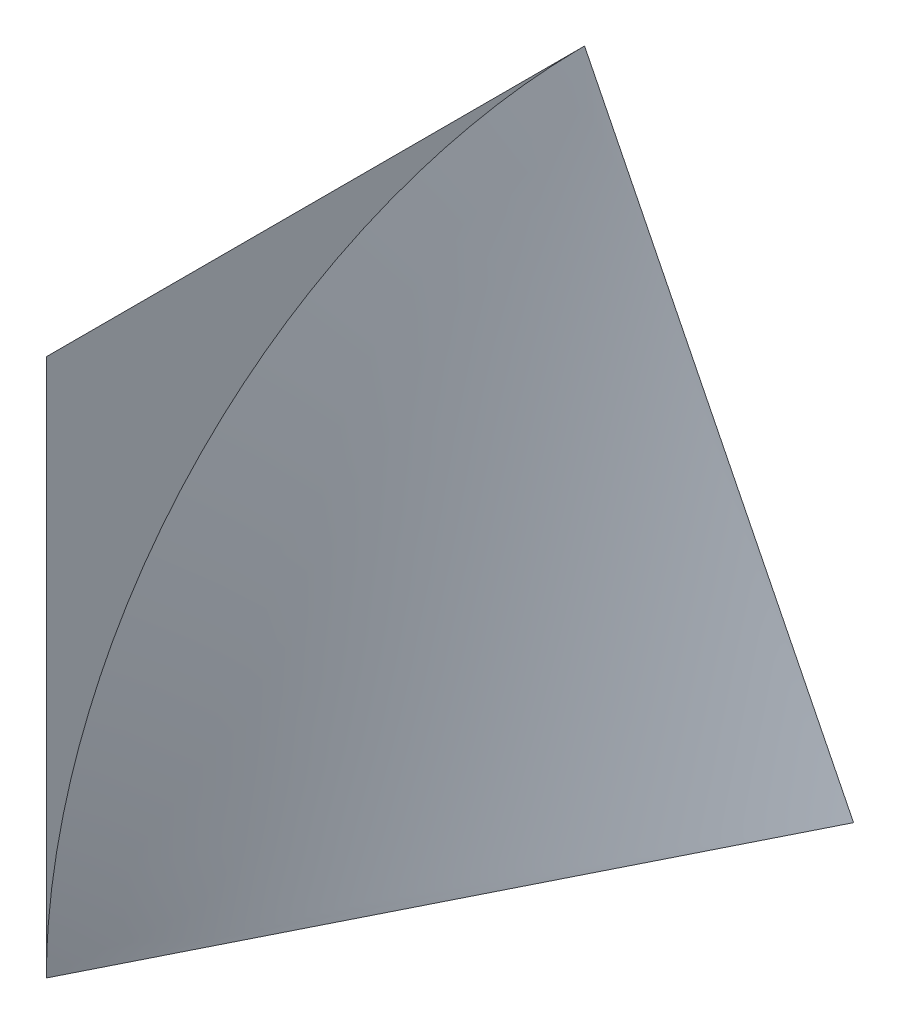
ISO-10303-21;
HEADER;
FILE_DESCRIPTION(('STEP AP214'),'2;1');
FILE_NAME('part.step','',(''),(''),'','','');
FILE_SCHEMA(('AUTOMOTIVE_DESIGN { 1 0 10303 214 1 1 1 1 }'));
ENDSEC;
DATA;
#1=APPLICATION_CONTEXT('core data for automotive mechanical design processes');
#2=APPLICATION_PROTOCOL_DEFINITION('international standard','automotive_design',2000,#1);
#3=PRODUCT_CONTEXT('',#1,'mechanical');
#4=PRODUCT('Part','Part','',(#3));
#5=PRODUCT_RELATED_PRODUCT_CATEGORY('part','',(#4));
#6=PRODUCT_DEFINITION_FORMATION('','',#4);
#7=PRODUCT_DEFINITION_CONTEXT('part definition',#1,'design');
#8=PRODUCT_DEFINITION('design','',#6,#7);
#9=PRODUCT_DEFINITION_SHAPE('','',#8);
#10=(LENGTH_UNIT() NAMED_UNIT(*) SI_UNIT(.MILLI.,.METRE.));
#11=(NAMED_UNIT(*) PLANE_ANGLE_UNIT() SI_UNIT($,.RADIAN.));
#12=(NAMED_UNIT(*) SI_UNIT($,.STERADIAN.) SOLID_ANGLE_UNIT());
#13=UNCERTAINTY_MEASURE_WITH_UNIT(LENGTH_MEASURE(1.E-05),#10,'distance_accuracy_value','');
#14=(GEOMETRIC_REPRESENTATION_CONTEXT(3) GLOBAL_UNCERTAINTY_ASSIGNED_CONTEXT((#13)) GLOBAL_UNIT_ASSIGNED_CONTEXT((#10,
#11,#12)) REPRESENTATION_CONTEXT('',''));
#15=CARTESIAN_POINT('',(0.,0.,0.));
#16=DIRECTION('',(0.,0.,1.));
#17=DIRECTION('',(1.,0.,0.));
#18=AXIS2_PLACEMENT_3D('',#15,#16,#17);
#19=CARTESIAN_POINT('',(0.,0.,0.));
#20=DIRECTION('',(0.,-1.,0.));
#21=DIRECTION('',(0.,0.,-1.));
#22=AXIS2_PLACEMENT_3D('',#19,#20,#21);
#23=PLANE('',#22);
#24=DIRECTION('',(0.447188418671129,0.,0.894439778971405));
#25=VECTOR('',#24,1.);
#26=CARTESIAN_POINT('',(-1.99987335916185,0.,-2.00000031664622));
#27=LINE('',#26,#25);
#28=CARTESIAN_POINT('',(-1.99987335916185,1.37456985586429E-05,-2.00000031664622));
#29=VERTEX_POINT('',#28);
#30=CARTESIAN_POINT('',(-3.56157288495491E-05,6.97657941034187E-05,2.00006976573752));
#31=VERTEX_POINT('',#30);
#32=EDGE_CURVE('E89',#29,#31,#27,.T.);
#33=ORIENTED_EDGE('',*,*,#32,.F.);
#34=DIRECTION('',(-1.,0.,0.));
#35=VECTOR('',#34,1.);
#36=CARTESIAN_POINT('',(-2.,0.,-2.));
#37=LINE('',#36,#35);
#38=CARTESIAN_POINT('',(1.99989168434998,-8.3713605003607E-06,-2.0000083713605));
#39=VERTEX_POINT('',#38);
#40=EDGE_CURVE('E57',#39,#29,#37,.T.);
#41=ORIENTED_EDGE('',*,*,#40,.F.);
#42=CARTESIAN_POINT('',(0.000875798366615509,0.000279063176195504,2.00027906272354));
#43=CARTESIAN_POINT('',(0.0837069902664033,0.000114321391326568,1.83341790211676));
#44=CARTESIAN_POINT('',(0.166760266654798,2.5824815957855E-05,1.66666738616965));
#45=CARTESIAN_POINT('',(0.333150650163644,-6.07299361798723E-05,1.33325678604981));
#46=CARTESIAN_POINT('',(0.416487821975475,-5.87658988175555E-05,1.16659673413993));
#47=CARTESIAN_POINT('',(0.5832516993621,-2.6430144579629E-05,0.833304277000826));
#48=CARTESIAN_POINT('',(0.66667841177579,3.94392325566219E-06,0.666671875201032));
#49=CARTESIAN_POINT('',(0.833462796655206,4.21516981306896E-05,0.333381132018225));
#50=CARTESIAN_POINT('',(0.91682047184071,4.99863399270686E-05,0.166722791997599));
#51=CARTESIAN_POINT('',(1.08344561174981,3.64771559339593E-05,-0.166625790121181));
#52=CARTESIAN_POINT('',(1.16671308184419,1.51351750872063E-05,-0.333316029535826));
#53=CARTESIAN_POINT('',(1.33324950456927,-2.7255169058637E-05,-0.666697336870446));
#54=CARTESIAN_POINT('',(1.41651845720639,-4.83035301613499E-05,-0.833388404787299));
#55=CARTESIAN_POINT('',(1.58319168850622,-4.59503601463192E-05,-1.16671774407098));
#56=CARTESIAN_POINT('',(1.66659597640317,-2.25456564726301E-05,-1.33335601082054));
#57=CARTESIAN_POINT('',(1.8333375242331,2.90581819594307E-06,-1.66665390369432));
#58=CARTESIAN_POINT('',(1.91667478779334,4.95383540343697E-06,-1.83331352800475));
#59=CARTESIAN_POINT('',(1.99988521040192,-3.65764076934509E-05,-2.00003657640769));
#60=B_SPLINE_CURVE_WITH_KNOTS('',3,(#42,#43,#44,#45,#46,#47,#48,#49,#50,#51,#52,#53,#54,#55,#56,
#57,#58,#59),.UNSPECIFIED.,.F.,.F.,(4,2,2,2,2,2,2,2,4),(0.,0.558866956671007,1.117871153294,
1.67692161219078,2.23594888577383,2.79494081168776,3.35393691681514,3.91297291824808,
4.47197629844018),.UNSPECIFIED.);
#61=EDGE_CURVE('E73',#39,#31,#60,.F.);
#62=ORIENTED_EDGE('',*,*,#61,.T.);
#63=EDGE_LOOP('',(#33,#41,#62));
#64=FACE_BOUND('',#63,.T.);
#65=ADVANCED_FACE('F45',(#64),#23,.T.);
#66=CARTESIAN_POINT('',(-2.,4.,-2.));
#67=DIRECTION('',(0.,0.,1.));
#68=DIRECTION('',(1.,0.,0.));
#69=AXIS2_PLACEMENT_3D('',#66,#67,#68);
#70=PLANE('',#69);
#71=ORIENTED_EDGE('',*,*,#40,.T.);
#72=DIRECTION('',(0.447189270772676,0.894439352950105,0.));
#73=VECTOR('',#72,1.);
#74=CARTESIAN_POINT('',(-1.99989639075497,-9.28745872898386E-06,-2.));
#75=LINE('',#74,#73);
#76=CARTESIAN_POINT('',(-1.39406305274967E-05,4.00002756846773,-1.99997243153227));
#77=VERTEX_POINT('',#76);
#78=EDGE_CURVE('E227',#29,#77,#75,.T.);
#79=ORIENTED_EDGE('',*,*,#78,.T.);
#80=CARTESIAN_POINT('',(1.99988521040192,-3.65764076902739E-05,-2.00003657640769));
#81=CARTESIAN_POINT('',(1.91654485122619,0.166627903865693,-2.00003880792397));
#82=CARTESIAN_POINT('',(1.83320103399918,0.333290657306252,-2.0000422271948));
#83=CARTESIAN_POINT('',(1.66652639514234,0.666620305131661,-2.00004492483027));
#84=CARTESIAN_POINT('',(1.58319557337616,0.833287199448332,-2.00004420324175));
#85=CARTESIAN_POINT('',(1.41656681786021,1.16663275869716,-2.0000321032242));
#86=CARTESIAN_POINT('',(1.33326888341521,1.33331142328179,-2.000020725034));
#87=CARTESIAN_POINT('',(1.16668077614414,1.66667133956219,-1.99999547984068));
#88=CARTESIAN_POINT('',(1.0833906032732,1.83335259123553,-1.99998161285297));
#89=CARTESIAN_POINT('',(0.916788519100106,2.16670770044612,-1.99996086981952));
#90=CARTESIAN_POINT('',(0.833476607459166,2.3333815578141,-1.99995399389016));
#91=CARTESIAN_POINT('',(0.666818288562755,2.66671732680947,-1.99995136478653));
#92=CARTESIAN_POINT('',(0.583471880483026,2.83337923802468,-1.99995561189546));
#93=CARTESIAN_POINT('',(0.416766179249375,3.16669651780215,-1.99996854669685));
#94=CARTESIAN_POINT('',(0.333406886102092,3.33335188636771,-1.99997723438705));
#95=CARTESIAN_POINT('',(0.166782488533559,3.66669263770975,-1.99996459731462));
#96=CARTESIAN_POINT('',(0.0835173769603532,3.83337801691231,-1.99994327500886));
#97=CARTESIAN_POINT('',(0.000346078090228706,4.00011027387091,-1.99988972612908));
#98=B_SPLINE_CURVE_WITH_KNOTS('',3,(#80,#81,#82,#83,#84,#85,#86,#87,#88,#89,#90,#91,#92,#93,#94,
#95,#96,#97),.UNSPECIFIED.,.F.,.F.,(4,2,2,2,2,2,2,2,4),(0.,0.559020558287219,1.11803479226773,
1.67703649758111,2.23603474063693,2.79504228889593,3.35406406956563,3.91308556318331,
4.47206129348129),.UNSPECIFIED.);
#99=EDGE_CURVE('E107',#77,#39,#98,.F.);
#100=ORIENTED_EDGE('',*,*,#99,.T.);
#101=EDGE_LOOP('',(#71,#79,#100));
#102=FACE_BOUND('',#101,.T.);
#103=ADVANCED_FACE('F47',(#102),#70,.F.);
#104=CARTESIAN_POINT('',(-0.0223445822368762,4.04551000308371,-2.05013568896862));
#105=CARTESIAN_POINT('',(0.389245917586985,3.22979955401737,-2.04815105747686));
#106=CARTESIAN_POINT('',(0.80376631841207,2.41502268478151,-2.04523284615462));
#107=CARTESIAN_POINT('',(1.2138327944319,1.59882662275964,-2.0437338276184));
#108=CARTESIAN_POINT('',(1.62547477029438,0.783132575951057,-2.04173279386888));
#109=CARTESIAN_POINT('',(2.0363210381082,-0.0328150142314784,-2.03998530349331));
#110=CARTESIAN_POINT('',(-0.00157645550172039,4.01078979222863,-1.12088691832415));
#111=CARTESIAN_POINT('',(0.330782508042385,3.1698331098672,-1.14414852012748));
#112=CARTESIAN_POINT('',(0.661463515093786,2.32834176563927,-1.16794478379732));
#113=CARTESIAN_POINT('',(0.998024508618965,1.48872401262588,-1.1898674562526));
#114=CARTESIAN_POINT('',(1.3496576785027,0.65390883821288,-1.20698755010751));
#115=CARTESIAN_POINT('',(1.70166608078987,-0.180786772636899,-1.22398808039919));
#116=CARTESIAN_POINT('',(-0.0801410042412669,3.94441834732446,-0.223289381728774));
#117=CARTESIAN_POINT('',(0.212645880851122,3.09085246954069,-0.259160178954445));
#118=CARTESIAN_POINT('',(0.487497486294741,2.23157171766153,-0.3007458502755));
#119=CARTESIAN_POINT('',(0.76296722670346,1.37248792750071,-0.342134559878237));
#120=CARTESIAN_POINT('',(1.0370474490773,0.512961383127122,-0.383966023693716));
#121=CARTESIAN_POINT('',(1.33318970498991,-0.339535343678444,-0.418767669941185));
#122=CARTESIAN_POINT('',(-0.225399102421753,3.85679575688504,0.653057009331347));
#123=CARTESIAN_POINT('',(0.0687644817012423,3.00366854868332,0.617624881687722));
#124=CARTESIAN_POINT('',(0.316590909279943,2.13577652940659,0.567427942969095));
#125=CARTESIAN_POINT('',(0.464826169582532,1.23615091059074,0.485497404711355));
#126=CARTESIAN_POINT('',(0.713655116844502,0.368578332877242,0.435619907555955));
#127=CARTESIAN_POINT('',(0.961196515742705,-0.499404507566119,0.385332147670681));
#128=CARTESIAN_POINT('',(-0.42444655194897,3.75203379774657,1.51226403169242));
#129=CARTESIAN_POINT('',(-0.154207559267555,2.8912832889579,1.46920860346185));
#130=CARTESIAN_POINT('',(0.0680055397752079,2.01522987211099,1.41085026717304));
#131=CARTESIAN_POINT('',(0.208824710855955,1.11324120030595,1.32655667592612));
#132=CARTESIAN_POINT('',(0.366742160711515,0.216700701730546,1.2477112579088));
#133=CARTESIAN_POINT('',(0.522343418228537,-0.680577825348242,1.1681278113881));
#134=CARTESIAN_POINT('',(-0.662558095217739,3.6348245067707,2.35902372221611));
#135=CARTESIAN_POINT('',(-0.408614144013187,2.76888176723662,2.31077606324013));
#136=CARTESIAN_POINT('',(-0.203038330924701,1.88752706731073,2.24711644387233));
#137=CARTESIAN_POINT('',(-0.0425084820645144,0.991818980144022,2.16910343726371));
#138=CARTESIAN_POINT('',(-0.0322366133536195,0.048232886322163,2.04321242399998));
#139=CARTESIAN_POINT('',(0.0386648782400475,-0.876034263607353,1.93664035462853));
#140=B_SPLINE_SURFACE_WITH_KNOTS('',5,5,((#104,#105,#106,#107,#108,#109),(#110,#111,#112,#113,
#114,#115),(#116,#117,#118,#119,#120,#121),(#122,#123,#124,#125,#126,#127),(#128,#129,#130,#131,
#132,#133),(#134,#135,#136,#137,#138,#139)),.UNSPECIFIED.,.F.,.F.,.F.,(6,6),(6,6),
(-1.64494672878529,2.79186118228678),(-2.54970046226169,1.96558601863418),.UNSPECIFIED.);
#141=CARTESIAN_POINT('',(0.000346078090228502,4.00011027387092,-1.99988972612909));
#142=CARTESIAN_POINT('',(0.000340741411696202,4.00010857405014,-1.99897851564378));
#143=CARTESIAN_POINT('',(0.000335437691624804,4.00010657119289,-1.99806730553074));
#144=CARTESIAN_POINT('',(0.000324895936222993,4.00010195943391,-1.99624492105267));
#145=CARTESIAN_POINT('',(0.000319657898406586,4.0000993505552,-1.99533374668759));
#146=CARTESIAN_POINT('',(0.000309247068695348,4.00009352676374,-1.99351143426773));
#147=CARTESIAN_POINT('',(0.000304074274320183,4.00009031187411,-1.99260029621289));
#148=CARTESIAN_POINT('',(0.00029379349458493,4.00008327607177,-1.99077805697498));
#149=CARTESIAN_POINT('',(0.000288685506750293,4.00007945518227,-1.98986695579183));
#150=CARTESIAN_POINT('',(0.000278533904599104,4.00007120739162,-1.98804479085794));
#151=CARTESIAN_POINT('',(0.00027349028781393,4.00006678051379,-1.98713372710711));
#152=CARTESIAN_POINT('',(0.000263466993815141,4.00005732075837,-1.98531163759767));
#153=CARTESIAN_POINT('',(0.000258487314138966,4.00005228790421,-1.98440061183894));
#154=CARTESIAN_POINT('',(0.000248591461917345,4.00004161620854,-1.9825785988727));
#155=CARTESIAN_POINT('',(0.000243675286915538,4.00003597739054,-1.98166761166505));
#156=CARTESIAN_POINT('',(0.000233906013124367,4.00002409378007,-1.97984567635912));
#157=CARTESIAN_POINT('',(0.000229052911884976,4.00001784901121,-1.97893472826069));
#158=CARTESIAN_POINT('',(0.000219409356213384,4.00000475351239,-1.97711287173051));
#159=CARTESIAN_POINT('',(0.00021461889933762,3.99999790280614,-1.97620196329861));
#160=CARTESIAN_POINT('',(0.000205100204507336,3.99998359544635,-1.97438018665798));
#161=CARTESIAN_POINT('',(0.000200371964115848,3.99997613881663,-1.97346931844909));
#162=CARTESIAN_POINT('',(0.000190977275881993,3.99996061962424,-1.97164762281017));
#163=CARTESIAN_POINT('',(0.000186310825609382,3.99995255708549,-1.97073679537994));
#164=CARTESIAN_POINT('',(0.000177039292757789,3.99993582608984,-1.96891518185321));
#165=CARTESIAN_POINT('',(0.000172434207755413,3.99992715765696,-1.96800439575649));
#166=CARTESIAN_POINT('',(0.000163284982099039,3.99990921488834,-1.96618286545078));
#167=CARTESIAN_POINT('',(0.000158740839028621,3.99989994057671,-1.96527212124157));
#168=CARTESIAN_POINT('',(0.000149713075430851,3.99988078606639,-1.96345067526409));
#169=CARTESIAN_POINT('',(0.000145229452494175,3.99987090589189,-1.96253997349557));
#170=CARTESIAN_POINT('',(0.000136322308768512,3.99985053967208,-1.96071861295185));
#171=CARTESIAN_POINT('',(0.000131898785577424,3.99984005365108,-1.95980795417639));
#172=CARTESIAN_POINT('',(0.000123111422852146,3.99981847575501,-1.95798668017033));
#173=CARTESIAN_POINT('',(0.000118747580923181,3.99980738390434,-1.95707606493946));
#174=CARTESIAN_POINT('',(0.000114413284051044,3.99979598890504,-1.95616545336141));
#175=B_SPLINE_CURVE_WITH_KNOTS('',3,(#141,#142,#143,#144,#145,#146,#147,#148,#149,#150,#151,
#152,#153,#154,#155,#156,#157,#158,#159,#160,#161,#162,#163,#164,#165,#166,#167,#168,#169,#170,
#171,#172,#173,#174),.UNSPECIFIED.,.F.,.F.,(4,2,2,2,2,2,2,2,2,2,2,2,2,2,2,2,4),(0.,
0.00273368304377199,0.00546726230673018,0.00820073733311294,0.0109341076694122,
0.0136673728643797,0.0164005324690386,0.0191335860366666,0.0218665331228122,0.0245993732852783,
0.0273321060841429,0.0300647310817479,0.0327972478426922,0.0355296559338529,0.0382619549243627,
0.0409941443856234,0.0437262238913072),.UNSPECIFIED.);
#176=CARTESIAN_POINT('',(-1.39406305274967E-05,4.00002756846773,-1.95552467436146));
#177=VERTEX_POINT('',#176);
#178=EDGE_CURVE('E164',#77,#177,#175,.T.);
#179=CARTESIAN_POINT('',(0.000114413284051044,3.99979598890504,-1.95616545336141));
#180=CARTESIAN_POINT('',(-4.20759593877336E-05,3.9993834858731,-1.92319617915899));
#181=CARTESIAN_POINT('',(-0.00016069575108772,3.9985734865051,-1.89023165299681));
#182=CARTESIAN_POINT('',(-0.000338348891529763,3.99615812133914,-1.82438591957091));
#183=CARTESIAN_POINT('',(-0.000397479970665175,3.99455406653796,-1.79150466446389));
#184=CARTESIAN_POINT('',(-0.00047264838987511,3.99055246402583,-1.72584958911145));
#185=CARTESIAN_POINT('',(-0.000488762824590513,3.9881563445337,-1.69307568194793));
#186=CARTESIAN_POINT('',(-0.000491279144068526,3.98257343447877,-1.62765813589121));
#187=CARTESIAN_POINT('',(-0.000477737558997291,3.97938815846872,-1.59501436777681));
#188=CARTESIAN_POINT('',(-0.000432158236712272,3.97223056766827,-1.52987866958958));
#189=CARTESIAN_POINT('',(-0.000400157192578298,3.96825982446136,-1.49738656683266));
#190=CARTESIAN_POINT('',(-0.000326639769874252,3.95953574145084,-1.43257458573135));
#191=CARTESIAN_POINT('',(-0.000285142794070655,3.95478400293546,-1.40025449185787));
#192=CARTESIAN_POINT('',(-0.000199611987180522,3.94450313325472,-1.33580580562727));
#193=CARTESIAN_POINT('',(-0.000155583505984348,3.93897560833752,-1.30367695706604));
#194=CARTESIAN_POINT('',(-7.01437501822807E-05,3.92714908737518,-1.23962901351558));
#195=CARTESIAN_POINT('',(-2.87273423747876E-05,3.9208516807513,-1.20770962507078));
#196=CARTESIAN_POINT('',(4.79462731554424E-05,3.90749198360928,-1.14409791685609));
#197=CARTESIAN_POINT('',(8.32156265839337E-05,3.90043124712203,-1.112405270743));
#198=CARTESIAN_POINT('',(0.000145448681763297,3.88555208890956,-1.04926351706417));
#199=CARTESIAN_POINT('',(0.000172428435948133,3.87773517060815,-1.01781405524871));
#200=CARTESIAN_POINT('',(0.00021710879366951,3.86135140284971,-0.955174388306056));
#201=CARTESIAN_POINT('',(0.000234826787253605,3.85278599433924,-0.923983806308075));
#202=CARTESIAN_POINT('',(0.000260961000445859,3.83491349983367,-0.861876959277292));
#203=CARTESIAN_POINT('',(0.000269393990294053,3.82560778367307,-0.830960300052744));
#204=CARTESIAN_POINT('',(0.000277669008786244,3.80626337297501,-0.769415793699323));
#205=CARTESIAN_POINT('',(0.000277525843411784,3.79622597155813,-0.738787540117821));
#206=CARTESIAN_POINT('',(0.000269884616516547,3.77542728381174,-0.677833865223859));
#207=CARTESIAN_POINT('',(0.000262398611557581,3.76466721104786,-0.647508029805282));
#208=CARTESIAN_POINT('',(0.000241638071543765,3.74243262225625,-0.587172822526307));
#209=CARTESIAN_POINT('',(0.000228372529586612,3.73095923983862,-0.557163032894566));
#210=CARTESIAN_POINT('',(0.000197772490382675,3.70730777992897,-0.497473241024717));
#211=CARTESIAN_POINT('',(0.000180443973433798,3.69513075778755,-0.46779282059722));
#212=CARTESIAN_POINT('',(0.000143432385765898,3.67008204337703,-0.408774856273472));
#213=CARTESIAN_POINT('',(0.000123752593008986,3.65721133163229,-0.379436896200637));
#214=CARTESIAN_POINT('',(8.36209617055915E-05,3.63078549970784,-0.321116780724675));
#215=CARTESIAN_POINT('',(6.31701590100113E-05,3.6172312900797,-0.292134212719157));
#216=CARTESIAN_POINT('',(2.28175640227445E-05,3.58944899691501,-0.234537682042815));
#217=CARTESIAN_POINT('',(2.91512946167464E-06,3.57522175980994,-0.205923311071532));
#218=CARTESIAN_POINT('',(-3.52721635850852E-05,3.54610390153392,-0.149075785088087));
#219=CARTESIAN_POINT('',(-5.35588617476297E-05,3.53121406463265,-0.120842228359506));
#220=CARTESIAN_POINT('',(-8.74495268700017E-05,3.50078054695233,-0.0647688166152793));
#221=CARTESIAN_POINT('',(-0.000103056341629801,3.48523758237037,-0.0369285728885716));
#222=CARTESIAN_POINT('',(-0.000130951998178188,3.45350744037006,0.0183459546846189));
#223=CARTESIAN_POINT('',(-0.000143244087711199,3.4373209114901,0.0457806108223146));
#224=CARTESIAN_POINT('',(-0.000164252885244111,3.40431327053554,0.100231805857513));
#225=CARTESIAN_POINT('',(-0.000172972793489886,3.38749274126972,0.127248698045413));
#226=CARTESIAN_POINT('',(-0.000186944142860821,3.35322676132727,0.180852318629018));
#227=CARTESIAN_POINT('',(-0.000192198396193532,3.33578182947221,0.20743937867893));
#228=CARTESIAN_POINT('',(-0.000199657647522486,3.30027673958617,0.260171398652763));
#229=CARTESIAN_POINT('',(-0.000201864859148048,3.28221703796006,0.286316665878083));
#230=CARTESIAN_POINT('',(-0.00020389612454593,3.24549215472583,0.338153283978272));
#231=CARTESIAN_POINT('',(-0.000203721704478984,3.22682736850907,0.363844914976164));
#232=CARTESIAN_POINT('',(-0.000201822680443406,3.18890213218167,0.414762577473964));
#233=CARTESIAN_POINT('',(-0.000200098935166607,3.16964201773232,0.439988858984699));
#234=CARTESIAN_POINT('',(-0.000196013138072276,3.13053603317664,0.489964288435991));
#235=CARTESIAN_POINT('',(-0.00019365138409801,3.11069044023197,0.514713653255582));
#236=CARTESIAN_POINT('',(-0.000189189501416251,3.0704235219132,0.563723881162146));
#237=CARTESIAN_POINT('',(-0.000187089274390844,3.05000241645829,0.58798492493439));
#238=CARTESIAN_POINT('',(-0.000183950472939124,3.00859463320113,0.636007324457802));
#239=CARTESIAN_POINT('',(-0.000182911593917094,2.98760811944074,0.65976882165516));
#240=CARTESIAN_POINT('',(-0.000182516069881732,2.94507983555249,0.706781136890769));
#241=CARTESIAN_POINT('',(-0.000183159094970287,2.92353817513487,0.730032054174945));
#242=CARTESIAN_POINT('',(-0.000186502582317135,2.87991008440498,0.776012422523472));
#243=CARTESIAN_POINT('',(-0.000189202829581564,2.85782371125232,0.798741927823285));
#244=CARTESIAN_POINT('',(-0.000196742808874715,2.81311686074203,0.843668892347213));
#245=CARTESIAN_POINT('',(-0.000201582514260774,2.79049639003883,0.865866358193183));
#246=CARTESIAN_POINT('',(-0.000213164306412116,2.74473219103067,0.909718867281658));
#247=CARTESIAN_POINT('',(-0.000219906544699497,2.72158842118405,0.931373867171303));
#248=CARTESIAN_POINT('',(-0.000234735520481573,2.67478864542021,0.974131259615105));
#249=CARTESIAN_POINT('',(-0.000242822488438385,2.65113255230561,0.995233556727298));
#250=CARTESIAN_POINT('',(-0.000259485949235778,2.60331931206077,1.03687553056745));
#251=CARTESIAN_POINT('',(-0.000268062570264376,2.57916203478724,1.05741505786386));
#252=CARTESIAN_POINT('',(-0.000284602973639872,2.53035774759323,1.09792162417582));
#253=CARTESIAN_POINT('',(-0.000292566538023358,2.50571056737764,1.11788845800995));
#254=CARTESIAN_POINT('',(-0.000306601457610519,2.45593790201703,1.15723987459451));
#255=CARTESIAN_POINT('',(-0.000312671970426713,2.43081220920085,1.1766241946755));
#256=CARTESIAN_POINT('',(-0.000321565431367859,2.38009402490086,1.21480090600893));
#257=CARTESIAN_POINT('',(-0.000324386640819204,2.35450129094046,1.2335929751274));
#258=CARTESIAN_POINT('',(-0.000325426203659402,2.30286003579459,1.27057582076251));
#259=CARTESIAN_POINT('',(-0.000323641588885706,2.27681123144368,1.28876620187913));
#260=CARTESIAN_POINT('',(-0.000314288397937105,2.22426820848157,1.32453673996211));
#261=CARTESIAN_POINT('',(-0.000306715310424769,2.19777365823,1.3421164097835));
#262=CARTESIAN_POINT('',(-0.000284992231515787,2.14435003405732,1.37665639139076));
#263=CARTESIAN_POINT('',(-0.000270836323776046,2.11742059033315,1.39361613119113));
#264=CARTESIAN_POINT('',(-0.000235616229524818,2.06313859223329,1.42690678900366));
#265=CARTESIAN_POINT('',(-0.000214545124413968,2.03578564036306,1.44323705887627));
#266=CARTESIAN_POINT('',(-0.00016571220433193,1.98066849410179,1.47525900834481));
#267=CARTESIAN_POINT('',(-0.000137943106813169,1.95290388317625,1.49094997098292));
#268=CARTESIAN_POINT('',(-7.65397622207981E-05,1.89697567044607,1.52168325004487));
#269=CARTESIAN_POINT('',(-4.28986941260781E-05,1.86881164001282,1.53672478645031));
#270=CARTESIAN_POINT('',(2.87847151269312E-05,1.81209716452494,1.56614890090249));
#271=CARTESIAN_POINT('',(6.68324546330929E-05,1.78354628417145,1.58053063992301));
#272=CARTESIAN_POINT('',(0.000145236437556913,1.72607096243594,1.60862463406853));
#273=CARTESIAN_POINT('',(0.000185595621126795,1.69714608321532,1.62233599347224));
#274=CARTESIAN_POINT('',(0.000265956971170782,1.63893586238479,1.64907854754453));
#275=CARTESIAN_POINT('',(0.000305958576553201,1.60965008350234,1.66210879044527));
#276=CARTESIAN_POINT('',(0.000382475614411264,1.55073139134722,1.68747835021575));
#277=CARTESIAN_POINT('',(0.000418986009707757,1.52109804374438,1.69981665845181));
#278=CARTESIAN_POINT('',(0.000485094036964293,1.46149777376527,1.72379160005554));
#279=CARTESIAN_POINT('',(0.00051468133947525,1.43153042195655,1.73542716596422));
#280=CARTESIAN_POINT('',(0.000563444303547165,1.37127595553102,1.75798599798524));
#281=CARTESIAN_POINT('',(0.000582603799492625,1.34098841821875,1.7689081351785));
#282=CARTESIAN_POINT('',(0.000607223406714149,1.28010768404197,1.79002973834593));
#283=CARTESIAN_POINT('',(0.000612661389148868,1.24951407322356,1.80022801123222));
#284=CARTESIAN_POINT('',(0.000607099551885609,1.18803564265127,1.81989191462257));
#285=CARTESIAN_POINT('',(0.000596072107979873,1.1571504200899,1.82935628581366));
#286=CARTESIAN_POINT('',(0.00055577750881721,1.09510363512943,1.84754297594175));
#287=CARTESIAN_POINT('',(0.000526478502046965,1.06394168403793,1.85626396875962));
#288=CARTESIAN_POINT('',(0.000449201386807041,1.00135681338198,1.87295522902894));
#289=CARTESIAN_POINT('',(0.000401189475712186,0.969933522841525,1.88092410532931));
#290=CARTESIAN_POINT('',(0.000287868415475275,0.906841938281089,1.8961033710697));
#291=CARTESIAN_POINT('',(0.000222526980429196,0.875173295185925,1.90331230930076));
#292=CARTESIAN_POINT('',(7.82089835532468E-05,0.811607664639226,1.91696506173736));
#293=CARTESIAN_POINT('',(-7.9362918460889E-07,0.779710354616123,1.9234073736746));
#294=CARTESIAN_POINT('',(-0.000165975686456652,0.715704826809296,1.93552144665902));
#295=CARTESIAN_POINT('',(-0.000252168936859197,0.683596317649392,1.94119166772011));
#296=CARTESIAN_POINT('',(-0.000422190876573476,0.619186155168888,1.95175799210973));
#297=CARTESIAN_POINT('',(-0.000506014483863313,0.58688424380021,1.95665252213208));
#298=CARTESIAN_POINT('',(-0.000657542223539916,0.522093506571013,1.96566584143084));
#299=CARTESIAN_POINT('',(-0.000725207267876985,0.489604418332728,1.96978274468016));
#300=CARTESIAN_POINT('',(-0.000827097885278591,0.424452151723677,1.97724026437962));
#301=CARTESIAN_POINT('',(-0.000861236529306144,0.391788740422859,1.98057884577209));
#302=CARTESIAN_POINT('',(-0.000874387160120224,0.326325064218614,1.98647865379353));
#303=CARTESIAN_POINT('',(-0.00085328723836905,0.293524656115916,1.9890382906273));
#304=CARTESIAN_POINT('',(-0.000728980441126949,0.227835250169193,1.99337948034723));
#305=CARTESIAN_POINT('',(-0.000625680569032521,0.19494619405912,1.99516014841185));
#306=CARTESIAN_POINT('',(-0.000302806428260565,0.129123835042678,1.99794499259164));
#307=CARTESIAN_POINT('',(-8.31899864801285E-05,0.0961905204121433,1.99894888674543));
#308=CARTESIAN_POINT('',(0.00021159168502831,0.0632506542382231,1.99956666046948));
#309=B_SPLINE_CURVE_WITH_KNOTS('',3,(#179,#180,#181,#182,#183,#184,#185,#186,#187,#188,#189,
#190,#191,#192,#193,#194,#195,#196,#197,#198,#199,#200,#201,#202,#203,#204,#205,#206,#207,#208,
#209,#210,#211,#212,#213,#214,#215,#216,#217,#218,#219,#220,#221,#222,#223,#224,#225,#226,#227,
#228,#229,#230,#231,#232,#233,#234,#235,#236,#237,#238,#239,#240,#241,#242,#243,#244,#245,#246,
#247,#248,#249,#250,#251,#252,#253,#254,#255,#256,#257,#258,#259,#260,#261,#262,#263,#264,#265,
#266,#267,#268,#269,#270,#271,#272,#273,#274,#275,#276,#277,#278,#279,#280,#281,#282,#283,#284,
#285,#286,#287,#288,#289,#290,#291,#292,#293,#294,#295,#296,#297,#298,#299,#300,#301,#302,#303,
#304,#305,#306,#307,#308),.UNSPECIFIED.,.F.,.F.,(4,2,2,2,2,2,2,2,2,2,2,2,2,2,2,2,2,2,2,2,2,2,2,
2,2,2,2,2,2,2,2,2,2,2,2,2,2,2,2,2,2,2,2,2,2,2,2,2,2,2,2,2,2,2,2,2,2,2,2,2,2,2,2,2,4),(0.,
0.098914329292215,0.197665891572044,0.296240351622005,0.394627073076353,0.492818895419343,
0.590811848882345,0.688604823872838,0.786199210576922,0.883598522958307,0.980808019664309,
1.07783433246243,1.17468511087287,1.27136868971606,1.36789378442451,1.46426921722189,
1.56050367567937,1.65660550373768,1.75258252404009,1.84844189157226,1.94419066798504,
2.03983705789316,2.13538939080655,2.23085593209434,2.3262449113908,2.42156455551549,
2.51682312123425,2.61202892375827,2.70719035768582,2.80231590811255,2.8974141508312,
2.99249374184565,3.08756339775181,3.18263186978925,3.2777079154365,3.3728002722079,
3.46791763872735,3.563068668147,3.65826197852537,3.7535062023751,3.84881182043014,
3.94419179225315,4.03965765348159,4.13521932020763,4.23088536068044,4.32666327779357,
4.42255979306841,4.51858112128347,4.61473322362617,4.71102202633818,4.80745359138996,
4.90403422588328,5.00077051780475,5.09766928761675,5.19473744814954,5.29198176948349,
5.3894085510323,5.48702320977825,5.58482980132712,5.6828322994044,5.78106951994824,
5.87956078793737,5.97825174502,6.07705451476043,6.17589313214266),.UNSPECIFIED.);
#310=CARTESIAN_POINT('',(-1.39406305274967E-05,0.0636424465234545,2.));
#311=VERTEX_POINT('',#310);
#312=EDGE_CURVE('E101',#311,#177,#309,.F.);
#313=CARTESIAN_POINT('',(0.000211591685028632,0.0632506542382248,1.99956666046948));
#314=CARTESIAN_POINT('',(0.000223367217398455,0.0619389329255487,1.99959126689113));
#315=CARTESIAN_POINT('',(0.000235264746106753,0.0606272012330377,1.99961526160178));
#316=CARTESIAN_POINT('',(0.000259306385956399,0.0580037128909408,1.99966202818727));
#317=CARTESIAN_POINT('',(0.000271450498115683,0.0566919562412743,1.99968480005707));
#318=CARTESIAN_POINT('',(0.000295987853804129,0.0540684185913993,1.99972912144567));
#319=CARTESIAN_POINT('',(0.000308381098477927,0.0527566375911067,1.99975067095887));
#320=CARTESIAN_POINT('',(0.000333419279746431,0.0501330517561858,1.99979254813255));
#321=CARTESIAN_POINT('',(0.000346064217632293,0.0488212469214697,1.99981287578676));
#322=CARTESIAN_POINT('',(0.000371608354529606,0.046197613841922,1.99985230975052));
#323=CARTESIAN_POINT('',(0.000384507554999376,0.0448857855969992,1.99987141605306));
#324=CARTESIAN_POINT('',(0.000410562795523721,0.0422621060277386,1.99990840783241));
#325=CARTESIAN_POINT('',(0.000423718837225282,0.0409502547033066,1.99992629330139));
#326=CARTESIAN_POINT('',(0.000450290347573345,0.0383265292106403,1.99996084394319));
#327=CARTESIAN_POINT('',(0.000463705818077876,0.0370146550423095,1.99997750910727));
#328=CARTESIAN_POINT('',(0.00049079878218785,0.0343908840008081,2.00000961967966));
#329=CARTESIAN_POINT('',(0.000504476277885622,0.0330789871275397,2.00002506507823));
#330=CARTESIAN_POINT('',(0.000532095897168163,0.0304551707169148,2.00005473667086));
#331=CARTESIAN_POINT('',(0.000546038023103718,0.0291432511794604,2.00006896285408));
#332=CARTESIAN_POINT('',(0.000574189516121576,0.0265193893814412,2.00009619657816));
#333=CARTESIAN_POINT('',(0.000588398885838192,0.0252074471207798,2.00010920410701));
#334=CARTESIAN_POINT('',(0.000617087487993597,0.0225835397159879,2.00013400109551));
#335=CARTESIAN_POINT('',(0.000631566723376223,0.021271574571764,2.00014579054187));
#336=CARTESIAN_POINT('',(0.000660797686601718,0.0186476211365877,2.00016815194964));
#337=CARTESIAN_POINT('',(0.000675549417724886,0.0173356328455469,2.00017872389638));
#338=CARTESIAN_POINT('',(0.000705328010146354,0.0147116327490157,2.00019865090019));
#339=CARTESIAN_POINT('',(0.000720354875089307,0.0133996209434442,2.00020800594112));
#340=CARTESIAN_POINT('',(0.000750686380780576,0.0107755733441006,2.00022549974013));
#341=CARTESIAN_POINT('',(0.000765991025566761,0.00946353755025725,2.00023363848051));
#342=CARTESIAN_POINT('',(0.000796880743958647,0.00683944139303506,2.0002487002952));
#343=CARTESIAN_POINT('',(0.000812465822025269,0.00552738102959762,2.00025562335015));
#344=CARTESIAN_POINT('',(0.000843919068600399,0.00290323504267528,2.00026825442691));
#345=CARTESIAN_POINT('',(0.000859787242023732,0.00159114941914764,2.00027396242759));
#346=CARTESIAN_POINT('',(0.000875798141657869,0.000279063176631455,2.00027906317663));
#347=B_SPLINE_CURVE_WITH_KNOTS('',3,(#313,#314,#315,#316,#317,#318,#319,#320,#321,#322,#323,
#324,#325,#326,#327,#328,#329,#330,#331,#332,#333,#334,#335,#336,#337,#338,#339,#340,#341,#342,
#343,#344,#345,#346),.UNSPECIFIED.,.F.,.F.,(4,2,2,2,2,2,2,2,2,2,2,2,2,2,2,2,4),(0.,
0.00393601464733107,0.00787204554645573,0.0118080945337604,0.0157441637177053,
0.0196802554834757,0.0236163724976168,0.0275525177126753,0.0314886943718429,0.035424906013587,
0.0393611564762858,0.0432974499028583,0.0472337907453957,0.0511701837697824,0.0551066340603251,
0.0590431470243664,0.0629797283969047),.UNSPECIFIED.);
#348=EDGE_CURVE('E91',#311,#31,#347,.T.);
#349=ORIENTED_EDGE('',*,*,#61,.F.);
#350=ORIENTED_EDGE('',*,*,#99,.F.);
#351=ORIENTED_EDGE('',*,*,#178,.T.);
#352=ORIENTED_EDGE('',*,*,#312,.F.);
#353=ORIENTED_EDGE('',*,*,#348,.T.);
#354=EDGE_LOOP('',(#349,#350,#351,#352,#353));
#355=FACE_BOUND('',#354,.T.);
#356=ADVANCED_FACE('F98',(#355),#140,.T.);
#357=CARTESIAN_POINT('',(-1.39406305274967E-05,-9.28745872898386E-06,2.));
#358=DIRECTION('',(1.,0.,0.));
#359=DIRECTION('',(0.,0.,-1.));
#360=AXIS2_PLACEMENT_3D('',#357,#358,#359);
#361=PLANE('',#360);
#362=DIRECTION('',(0.,0.,-1.));
#363=VECTOR('',#362,1.);
#364=CARTESIAN_POINT('',(-1.39406305274967E-05,4.00002756846773,2.));
#365=LINE('',#364,#363);
#366=CARTESIAN_POINT('',(-2.57896508079426E-05,4.00000386881587,1.9999967933926));
#367=VERTEX_POINT('',#366);
#368=EDGE_CURVE('E108',#367,#177,#365,.T.);
#369=ORIENTED_EDGE('',*,*,#368,.F.);
#370=DIRECTION('',(0.,-1.,0.));
#371=VECTOR('',#370,1.);
#372=CARTESIAN_POINT('',(-1.39406305274967E-05,4.,2.));
#373=LINE('',#372,#371);
#374=EDGE_CURVE('E65',#367,#311,#373,.T.);
#375=ORIENTED_EDGE('',*,*,#374,.T.);
#376=ORIENTED_EDGE('',*,*,#312,.T.);
#377=EDGE_LOOP('',(#369,#375,#376));
#378=FACE_BOUND('',#377,.T.);
#379=ADVANCED_FACE('F129',(#378),#361,.T.);
#380=CARTESIAN_POINT('',(-1.99989639075497,-9.28745872898386E-06,-2.));
#381=DIRECTION('',(0.894439352950105,-0.447189270772676,0.));
#382=DIRECTION('',(0.447189270772676,0.894439352950105,0.));
#383=AXIS2_PLACEMENT_3D('',#380,#381,#382);
#384=PLANE('',#383);
#385=ORIENTED_EDGE('',*,*,#78,.F.);
#386=DIRECTION('',(0.33331283558774,0.666670996998523,0.666672584852156));
#387=VECTOR('',#386,1.);
#388=CARTESIAN_POINT('',(-1.9998860839475,1.13275578021721E-05,-2.00002576800852));
#389=LINE('',#388,#387);
#390=EDGE_CURVE('E12',#29,#367,#389,.T.);
#391=ORIENTED_EDGE('',*,*,#390,.T.);
#392=ORIENTED_EDGE('',*,*,#368,.T.);
#393=ORIENTED_EDGE('',*,*,#178,.F.);
#394=EDGE_LOOP('',(#385,#391,#392,#393));
#395=FACE_BOUND('',#394,.T.);
#396=ADVANCED_FACE('F171',(#395),#384,.F.);
#397=CARTESIAN_POINT('',(-1.99987335916185,4.,-2.00000031664622));
#398=DIRECTION('',(0.894439778971405,0.,-0.447188418671129));
#399=DIRECTION('',(-0.447188418671129,0.,-0.894439778971404));
#400=AXIS2_PLACEMENT_3D('',#397,#398,#399);
#401=PLANE('',#400);
#402=ORIENTED_EDGE('',*,*,#32,.T.);
#403=ORIENTED_EDGE('',*,*,#348,.F.);
#404=ORIENTED_EDGE('',*,*,#374,.F.);
#405=ORIENTED_EDGE('',*,*,#390,.F.);
#406=EDGE_LOOP('',(#402,#403,#404,#405));
#407=FACE_BOUND('',#406,.T.);
#408=ADVANCED_FACE('F90',(#407),#401,.F.);
#409=CLOSED_SHELL('',(#65,#103,#356,#379,#396,#408));
#410=MANIFOLD_SOLID_BREP('B2',#409);
#411=ADVANCED_BREP_SHAPE_REPRESENTATION('',(#18,#410),#14);
#412=SHAPE_DEFINITION_REPRESENTATION(#9,#411);
ENDSEC;
END-ISO-10303-21;
